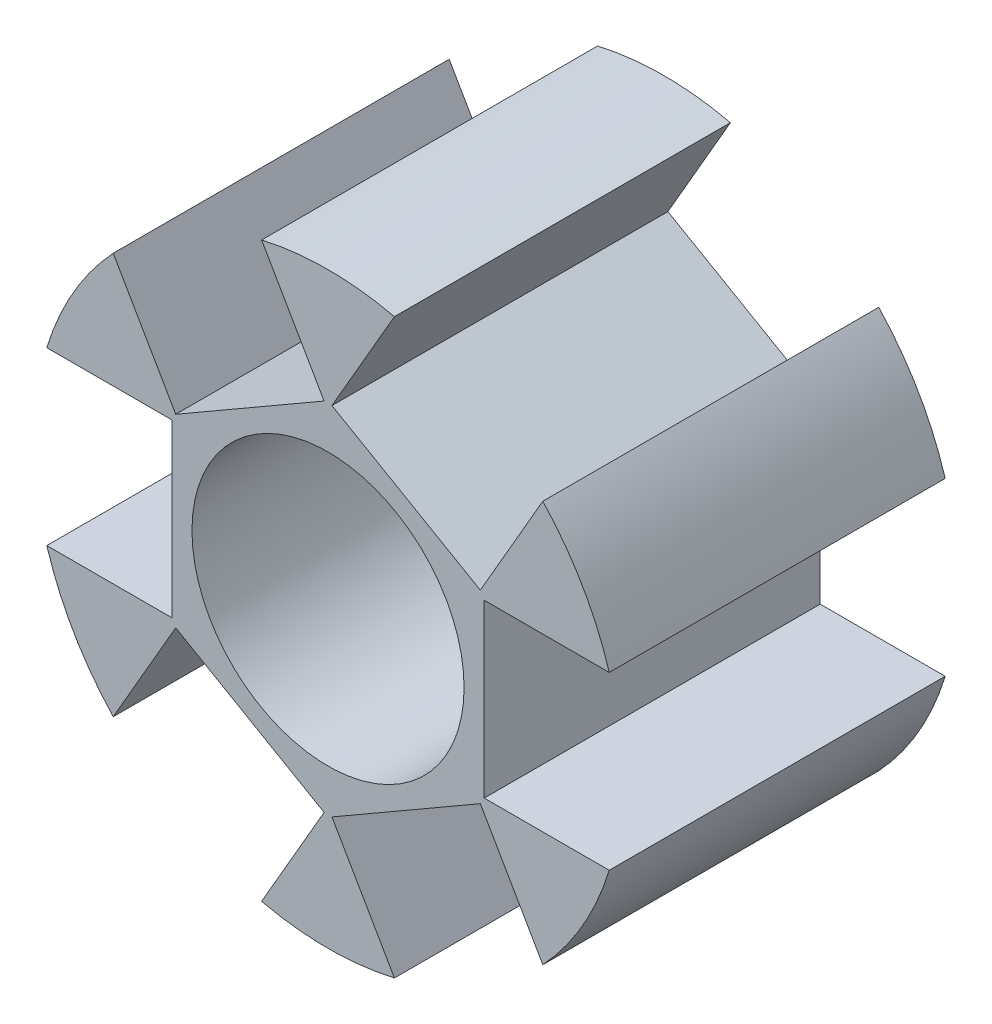
ISO-10303-21;
HEADER;
FILE_DESCRIPTION(('STEP AP214'),'2;1');
FILE_NAME('part.step','',(''),(''),'','','');
FILE_SCHEMA(('AUTOMOTIVE_DESIGN { 1 0 10303 214 1 1 1 1 }'));
ENDSEC;
DATA;
#1=APPLICATION_CONTEXT('core data for automotive mechanical design processes');
#2=APPLICATION_PROTOCOL_DEFINITION('international standard','automotive_design',2000,#1);
#3=PRODUCT_CONTEXT('',#1,'mechanical');
#4=PRODUCT('Part','Part','',(#3));
#5=PRODUCT_RELATED_PRODUCT_CATEGORY('part','',(#4));
#6=PRODUCT_DEFINITION_FORMATION('','',#4);
#7=PRODUCT_DEFINITION_CONTEXT('part definition',#1,'design');
#8=PRODUCT_DEFINITION('design','',#6,#7);
#9=PRODUCT_DEFINITION_SHAPE('','',#8);
#10=(LENGTH_UNIT() NAMED_UNIT(*) SI_UNIT(.MILLI.,.METRE.));
#11=(NAMED_UNIT(*) PLANE_ANGLE_UNIT() SI_UNIT($,.RADIAN.));
#12=(NAMED_UNIT(*) SI_UNIT($,.STERADIAN.) SOLID_ANGLE_UNIT());
#13=UNCERTAINTY_MEASURE_WITH_UNIT(LENGTH_MEASURE(1.E-05),#10,'distance_accuracy_value','');
#14=(GEOMETRIC_REPRESENTATION_CONTEXT(3) GLOBAL_UNCERTAINTY_ASSIGNED_CONTEXT((#13)) GLOBAL_UNIT_ASSIGNED_CONTEXT((#10,
#11,#12)) REPRESENTATION_CONTEXT('',''));
#15=CARTESIAN_POINT('',(0.,0.,0.));
#16=DIRECTION('',(0.,0.,1.));
#17=DIRECTION('',(1.,0.,0.));
#18=AXIS2_PLACEMENT_3D('',#15,#16,#17);
#19=CARTESIAN_POINT('',(0.,0.,5.));
#20=DIRECTION('',(0.,0.,1.));
#21=DIRECTION('',(1.,0.,0.));
#22=AXIS2_PLACEMENT_3D('',#19,#20,#21);
#23=PLANE('',#22);
#24=CARTESIAN_POINT('',(0.,0.,5.));
#25=DIRECTION('',(0.,0.,1.));
#26=DIRECTION('',(1.,0.,0.));
#27=AXIS2_PLACEMENT_3D('',#24,#25,#26);
#28=CIRCLE('',#27,4.05);
#29=CARTESIAN_POINT('',(4.05,0.,5.));
#30=VERTEX_POINT('',#29);
#31=EDGE_CURVE('E337',#30,#30,#28,.T.);
#32=ORIENTED_EDGE('',*,*,#31,.F.);
#33=EDGE_LOOP('',(#32));
#34=FACE_BOUND('',#33,.T.);
#35=DIRECTION('',(-0.866025403784433,-0.50000000000001,0.));
#36=VECTOR('',#35,1.);
#37=CARTESIAN_POINT('',(-0.116635220349743,5.30201812759764,5.));
#38=LINE('',#37,#36);
#39=CARTESIAN_POINT('',(-0.116635220349743,5.30201812759764,5.));
#40=VERTEX_POINT('',#39);
#41=CARTESIAN_POINT('',(-4.53336477965035,2.75201812759759,5.));
#42=VERTEX_POINT('',#41);
#43=EDGE_CURVE('E284',#40,#42,#38,.T.);
#44=ORIENTED_EDGE('',*,*,#43,.T.);
#45=DIRECTION('',(-0.50000000000001,0.866025403784433,0.));
#46=VECTOR('',#45,1.);
#47=CARTESIAN_POINT('',(-4.53336477965035,2.75201812759759,5.));
#48=LINE('',#47,#46);
#49=CARTESIAN_POINT('',(-6.39345737121871,5.97379300297635,5.));
#50=VERTEX_POINT('',#49);
#51=EDGE_CURVE('E287',#42,#50,#48,.T.);
#52=ORIENTED_EDGE('',*,*,#51,.T.);
#53=CARTESIAN_POINT('',(0.,0.,5.));
#54=DIRECTION('',(0.,0.,1.));
#55=DIRECTION('',(1.,0.,0.));
#56=AXIS2_PLACEMENT_3D('',#53,#54,#55);
#57=CIRCLE('',#56,8.75);
#58=CARTESIAN_POINT('',(-8.37018518313663,2.55,5.));
#59=VERTEX_POINT('',#58);
#60=EDGE_CURVE('E350',#50,#59,#57,.T.);
#61=ORIENTED_EDGE('',*,*,#60,.T.);
#62=DIRECTION('',(-1.,0.,0.));
#63=VECTOR('',#62,1.);
#64=CARTESIAN_POINT('',(-4.65,2.55,5.));
#65=LINE('',#64,#63);
#66=CARTESIAN_POINT('',(-4.65,2.55,5.));
#67=VERTEX_POINT('',#66);
#68=EDGE_CURVE('E330',#67,#59,#65,.T.);
#69=ORIENTED_EDGE('',*,*,#68,.F.);
#70=DIRECTION('',(0.,-1.,0.));
#71=VECTOR('',#70,1.);
#72=CARTESIAN_POINT('',(-4.65,2.55,5.));
#73=LINE('',#72,#71);
#74=CARTESIAN_POINT('',(-4.65,-2.55,5.));
#75=VERTEX_POINT('',#74);
#76=EDGE_CURVE('E321',#67,#75,#73,.T.);
#77=ORIENTED_EDGE('',*,*,#76,.T.);
#78=DIRECTION('',(-1.,0.,0.));
#79=VECTOR('',#78,1.);
#80=CARTESIAN_POINT('',(-4.65,-2.55,5.));
#81=LINE('',#80,#79);
#82=CARTESIAN_POINT('',(-8.37018518313663,-2.55,5.));
#83=VERTEX_POINT('',#82);
#84=EDGE_CURVE('E323',#75,#83,#81,.T.);
#85=ORIENTED_EDGE('',*,*,#84,.T.);
#86=CARTESIAN_POINT('',(-6.39345737121862,-5.97379300297644,5.));
#87=VERTEX_POINT('',#86);
#88=EDGE_CURVE('E342',#83,#87,#57,.T.);
#89=ORIENTED_EDGE('',*,*,#88,.T.);
#90=DIRECTION('',(-0.499999999999998,-0.86602540378444,0.));
#91=VECTOR('',#90,1.);
#92=CARTESIAN_POINT('',(-4.53336477965031,-2.75201812759765,5.));
#93=LINE('',#92,#91);
#94=CARTESIAN_POINT('',(-4.53336477965031,-2.75201812759765,5.));
#95=VERTEX_POINT('',#94);
#96=EDGE_CURVE('E306',#95,#87,#93,.T.);
#97=ORIENTED_EDGE('',*,*,#96,.F.);
#98=DIRECTION('',(0.86602540378444,-0.499999999999998,0.));
#99=VECTOR('',#98,1.);
#100=CARTESIAN_POINT('',(-4.53336477965031,-2.75201812759765,5.));
#101=LINE('',#100,#99);
#102=CARTESIAN_POINT('',(-0.116635220349669,-5.30201812759764,5.));
#103=VERTEX_POINT('',#102);
#104=EDGE_CURVE('E297',#95,#103,#101,.T.);
#105=ORIENTED_EDGE('',*,*,#104,.T.);
#106=DIRECTION('',(-0.499999999999998,-0.86602540378444,0.));
#107=VECTOR('',#106,1.);
#108=CARTESIAN_POINT('',(-0.116635220349669,-5.30201812759764,5.));
#109=LINE('',#108,#107);
#110=CARTESIAN_POINT('',(-1.97672781191798,-8.52379300297643,5.));
#111=VERTEX_POINT('',#110);
#112=EDGE_CURVE('E303',#103,#111,#109,.T.);
#113=ORIENTED_EDGE('',*,*,#112,.T.);
#114=CARTESIAN_POINT('',(1.97672781191804,-8.52379300297642,5.));
#115=VERTEX_POINT('',#114);
#116=EDGE_CURVE('E348',#111,#115,#57,.T.);
#117=ORIENTED_EDGE('',*,*,#116,.T.);
#118=DIRECTION('',(0.500000000000004,-0.866025403784436,0.));
#119=VECTOR('',#118,1.);
#120=CARTESIAN_POINT('',(0.116635220349706,-5.30201812759764,5.));
#121=LINE('',#120,#119);
#122=CARTESIAN_POINT('',(0.116635220349706,-5.30201812759764,5.));
#123=VERTEX_POINT('',#122);
#124=EDGE_CURVE('E231',#123,#115,#121,.T.);
#125=ORIENTED_EDGE('',*,*,#124,.F.);
#126=DIRECTION('',(0.866025403784436,0.500000000000004,0.));
#127=VECTOR('',#126,1.);
#128=CARTESIAN_POINT('',(0.116635220349706,-5.30201812759764,5.));
#129=LINE('',#128,#127);
#130=CARTESIAN_POINT('',(4.53336477965033,-2.75201812759762,5.));
#131=VERTEX_POINT('',#130);
#132=EDGE_CURVE('E516',#123,#131,#129,.T.);
#133=ORIENTED_EDGE('',*,*,#132,.T.);
#134=DIRECTION('',(0.500000000000004,-0.866025403784436,0.));
#135=VECTOR('',#134,1.);
#136=CARTESIAN_POINT('',(4.53336477965033,-2.75201812759762,5.));
#137=LINE('',#136,#135);
#138=CARTESIAN_POINT('',(6.39345737121866,-5.9737930029764,5.));
#139=VERTEX_POINT('',#138);
#140=EDGE_CURVE('E216',#131,#139,#137,.T.);
#141=ORIENTED_EDGE('',*,*,#140,.T.);
#142=CARTESIAN_POINT('',(8.37018518313663,-2.55,5.));
#143=VERTEX_POINT('',#142);
#144=EDGE_CURVE('E430',#139,#143,#57,.T.);
#145=ORIENTED_EDGE('',*,*,#144,.T.);
#146=DIRECTION('',(1.,0.,0.));
#147=VECTOR('',#146,1.);
#148=CARTESIAN_POINT('',(4.65,-2.55,5.));
#149=LINE('',#148,#147);
#150=CARTESIAN_POINT('',(4.65,-2.55,5.));
#151=VERTEX_POINT('',#150);
#152=EDGE_CURVE('E255',#151,#143,#149,.T.);
#153=ORIENTED_EDGE('',*,*,#152,.F.);
#154=DIRECTION('',(0.,1.,0.));
#155=VECTOR('',#154,1.);
#156=CARTESIAN_POINT('',(4.65,-2.55,5.));
#157=LINE('',#156,#155);
#158=CARTESIAN_POINT('',(4.65,2.55,5.));
#159=VERTEX_POINT('',#158);
#160=EDGE_CURVE('E246',#151,#159,#157,.T.);
#161=ORIENTED_EDGE('',*,*,#160,.T.);
#162=DIRECTION('',(1.,0.,0.));
#163=VECTOR('',#162,1.);
#164=CARTESIAN_POINT('',(4.65,2.55,5.));
#165=LINE('',#164,#163);
#166=CARTESIAN_POINT('',(8.37018518313663,2.55,5.));
#167=VERTEX_POINT('',#166);
#168=EDGE_CURVE('E248',#159,#167,#165,.T.);
#169=ORIENTED_EDGE('',*,*,#168,.T.);
#170=CARTESIAN_POINT('',(6.39345737121858,5.97379300297649,5.));
#171=VERTEX_POINT('',#170);
#172=EDGE_CURVE('E429',#167,#171,#57,.T.);
#173=ORIENTED_EDGE('',*,*,#172,.T.);
#174=DIRECTION('',(0.499999999999992,0.866025403784443,0.));
#175=VECTOR('',#174,1.);
#176=CARTESIAN_POINT('',(4.53336477965029,2.75201812759768,5.));
#177=LINE('',#176,#175);
#178=CARTESIAN_POINT('',(4.53336477965029,2.75201812759768,5.));
#179=VERTEX_POINT('',#178);
#180=EDGE_CURVE('E63',#179,#171,#177,.T.);
#181=ORIENTED_EDGE('',*,*,#180,.F.);
#182=DIRECTION('',(-0.866025403784443,0.499999999999992,0.));
#183=VECTOR('',#182,1.);
#184=CARTESIAN_POINT('',(4.53336477965029,2.75201812759768,5.));
#185=LINE('',#184,#183);
#186=CARTESIAN_POINT('',(0.116635220349632,5.30201812759764,5.));
#187=VERTEX_POINT('',#186);
#188=EDGE_CURVE('E266',#179,#187,#185,.T.);
#189=ORIENTED_EDGE('',*,*,#188,.T.);
#190=DIRECTION('',(0.499999999999992,0.866025403784443,0.));
#191=VECTOR('',#190,1.);
#192=CARTESIAN_POINT('',(0.116635220349632,5.30201812759764,5.));
#193=LINE('',#192,#191);
#194=CARTESIAN_POINT('',(1.97672781191792,8.52379300297645,5.));
#195=VERTEX_POINT('',#194);
#196=EDGE_CURVE('E268',#187,#195,#193,.T.);
#197=ORIENTED_EDGE('',*,*,#196,.T.);
#198=CARTESIAN_POINT('',(-1.9767278119181,8.52379300297641,5.));
#199=VERTEX_POINT('',#198);
#200=EDGE_CURVE('E433',#195,#199,#57,.T.);
#201=ORIENTED_EDGE('',*,*,#200,.T.);
#202=DIRECTION('',(-0.50000000000001,0.866025403784433,0.));
#203=VECTOR('',#202,1.);
#204=CARTESIAN_POINT('',(-0.116635220349743,5.30201812759764,5.));
#205=LINE('',#204,#203);
#206=EDGE_CURVE('E57',#40,#199,#205,.T.);
#207=ORIENTED_EDGE('',*,*,#206,.F.);
#208=EDGE_LOOP('',(#44,#52,#61,#69,#77,#85,#89,#97,#105,#113,#117,#125,#133,#141,#145,#153,#161,
#169,#173,#181,#189,#197,#201,#207));
#209=FACE_BOUND('',#208,.T.);
#210=ADVANCED_FACE('F41',(#34,#209),#23,.T.);
#211=CARTESIAN_POINT('',(0.,0.,-5.));
#212=DIRECTION('',(0.,0.,1.));
#213=DIRECTION('',(1.,0.,0.));
#214=AXIS2_PLACEMENT_3D('',#211,#212,#213);
#215=PLANE('',#214);
#216=CARTESIAN_POINT('',(0.,0.,-5.));
#217=DIRECTION('',(0.,0.,1.));
#218=DIRECTION('',(1.,0.,0.));
#219=AXIS2_PLACEMENT_3D('',#216,#217,#218);
#220=CIRCLE('',#219,4.05);
#221=CARTESIAN_POINT('',(4.05,0.,-5.));
#222=VERTEX_POINT('',#221);
#223=EDGE_CURVE('E334',#222,#222,#220,.T.);
#224=ORIENTED_EDGE('',*,*,#223,.T.);
#225=EDGE_LOOP('',(#224));
#226=FACE_BOUND('',#225,.T.);
#227=DIRECTION('',(-0.50000000000001,0.866025403784433,0.));
#228=VECTOR('',#227,1.);
#229=CARTESIAN_POINT('',(-4.53336477965035,2.75201812759759,-5.));
#230=LINE('',#229,#228);
#231=CARTESIAN_POINT('',(-4.53336477965035,2.75201812759759,-5.));
#232=VERTEX_POINT('',#231);
#233=CARTESIAN_POINT('',(-6.39345737121871,5.97379300297635,-5.));
#234=VERTEX_POINT('',#233);
#235=EDGE_CURVE('E263',#232,#234,#230,.T.);
#236=ORIENTED_EDGE('',*,*,#235,.F.);
#237=DIRECTION('',(0.866025403784433,0.50000000000001,0.));
#238=VECTOR('',#237,1.);
#239=CARTESIAN_POINT('',(-0.116635220349743,5.30201812759764,-5.));
#240=LINE('',#239,#238);
#241=CARTESIAN_POINT('',(-0.116635220349743,5.30201812759764,-5.));
#242=VERTEX_POINT('',#241);
#243=EDGE_CURVE('E280',#232,#242,#240,.T.);
#244=ORIENTED_EDGE('',*,*,#243,.T.);
#245=DIRECTION('',(-0.50000000000001,0.866025403784433,0.));
#246=VECTOR('',#245,1.);
#247=CARTESIAN_POINT('',(-0.116635220349743,5.30201812759764,-5.));
#248=LINE('',#247,#246);
#249=CARTESIAN_POINT('',(-1.9767278119181,8.52379300297641,-5.));
#250=VERTEX_POINT('',#249);
#251=EDGE_CURVE('E292',#242,#250,#248,.T.);
#252=ORIENTED_EDGE('',*,*,#251,.T.);
#253=CARTESIAN_POINT('',(0.,0.,-5.));
#254=DIRECTION('',(0.,0.,1.));
#255=DIRECTION('',(1.,0.,0.));
#256=AXIS2_PLACEMENT_3D('',#253,#254,#255);
#257=CIRCLE('',#256,8.75);
#258=CARTESIAN_POINT('',(1.97672781191792,8.52379300297645,-5.));
#259=VERTEX_POINT('',#258);
#260=EDGE_CURVE('E378',#259,#250,#257,.T.);
#261=ORIENTED_EDGE('',*,*,#260,.F.);
#262=DIRECTION('',(0.499999999999992,0.866025403784443,0.));
#263=VECTOR('',#262,1.);
#264=CARTESIAN_POINT('',(0.116635220349632,5.30201812759764,-5.));
#265=LINE('',#264,#263);
#266=CARTESIAN_POINT('',(0.116635220349632,5.30201812759764,-5.));
#267=VERTEX_POINT('',#266);
#268=EDGE_CURVE('E241',#267,#259,#265,.T.);
#269=ORIENTED_EDGE('',*,*,#268,.F.);
#270=DIRECTION('',(0.866025403784443,-0.499999999999992,0.));
#271=VECTOR('',#270,1.);
#272=CARTESIAN_POINT('',(4.53336477965029,2.75201812759768,-5.));
#273=LINE('',#272,#271);
#274=CARTESIAN_POINT('',(4.53336477965029,2.75201812759768,-5.));
#275=VERTEX_POINT('',#274);
#276=EDGE_CURVE('E260',#267,#275,#273,.T.);
#277=ORIENTED_EDGE('',*,*,#276,.T.);
#278=DIRECTION('',(0.499999999999992,0.866025403784443,0.));
#279=VECTOR('',#278,1.);
#280=CARTESIAN_POINT('',(4.53336477965029,2.75201812759768,-5.));
#281=LINE('',#280,#279);
#282=CARTESIAN_POINT('',(6.39345737121858,5.97379300297649,-5.));
#283=VERTEX_POINT('',#282);
#284=EDGE_CURVE('E271',#275,#283,#281,.T.);
#285=ORIENTED_EDGE('',*,*,#284,.T.);
#286=CARTESIAN_POINT('',(8.37018518313663,2.55,-5.));
#287=VERTEX_POINT('',#286);
#288=EDGE_CURVE('E385',#287,#283,#257,.T.);
#289=ORIENTED_EDGE('',*,*,#288,.F.);
#290=DIRECTION('',(1.,0.,0.));
#291=VECTOR('',#290,1.);
#292=CARTESIAN_POINT('',(4.65,2.55,-5.));
#293=LINE('',#292,#291);
#294=CARTESIAN_POINT('',(4.65,2.55,-5.));
#295=VERTEX_POINT('',#294);
#296=EDGE_CURVE('E217',#295,#287,#293,.T.);
#297=ORIENTED_EDGE('',*,*,#296,.F.);
#298=DIRECTION('',(0.,-1.,0.));
#299=VECTOR('',#298,1.);
#300=CARTESIAN_POINT('',(4.65,-2.55,-5.));
#301=LINE('',#300,#299);
#302=CARTESIAN_POINT('',(4.65,-2.55,-5.));
#303=VERTEX_POINT('',#302);
#304=EDGE_CURVE('E239',#295,#303,#301,.T.);
#305=ORIENTED_EDGE('',*,*,#304,.T.);
#306=DIRECTION('',(1.,0.,0.));
#307=VECTOR('',#306,1.);
#308=CARTESIAN_POINT('',(4.65,-2.55,-5.));
#309=LINE('',#308,#307);
#310=CARTESIAN_POINT('',(8.37018518313663,-2.55,-5.));
#311=VERTEX_POINT('',#310);
#312=EDGE_CURVE('E251',#303,#311,#309,.T.);
#313=ORIENTED_EDGE('',*,*,#312,.T.);
#314=CARTESIAN_POINT('',(6.39345737121866,-5.9737930029764,-5.));
#315=VERTEX_POINT('',#314);
#316=EDGE_CURVE('E228',#315,#311,#257,.T.);
#317=ORIENTED_EDGE('',*,*,#316,.F.);
#318=DIRECTION('',(0.500000000000004,-0.866025403784436,0.));
#319=VECTOR('',#318,1.);
#320=CARTESIAN_POINT('',(4.53336477965033,-2.75201812759762,-5.));
#321=LINE('',#320,#319);
#322=CARTESIAN_POINT('',(4.53336477965033,-2.75201812759762,-5.));
#323=VERTEX_POINT('',#322);
#324=EDGE_CURVE('E215',#323,#315,#321,.T.);
#325=ORIENTED_EDGE('',*,*,#324,.F.);
#326=DIRECTION('',(-0.866025403784436,-0.500000000000004,0.));
#327=VECTOR('',#326,1.);
#328=CARTESIAN_POINT('',(0.116635220349706,-5.30201812759764,-5.));
#329=LINE('',#328,#327);
#330=CARTESIAN_POINT('',(0.116635220349706,-5.30201812759764,-5.));
#331=VERTEX_POINT('',#330);
#332=EDGE_CURVE('E205',#323,#331,#329,.T.);
#333=ORIENTED_EDGE('',*,*,#332,.T.);
#334=DIRECTION('',(0.500000000000004,-0.866025403784436,0.));
#335=VECTOR('',#334,1.);
#336=CARTESIAN_POINT('',(0.116635220349706,-5.30201812759764,-5.));
#337=LINE('',#336,#335);
#338=CARTESIAN_POINT('',(1.97672781191804,-8.52379300297642,-5.));
#339=VERTEX_POINT('',#338);
#340=EDGE_CURVE('E226',#331,#339,#337,.T.);
#341=ORIENTED_EDGE('',*,*,#340,.T.);
#342=CARTESIAN_POINT('',(-1.97672781191798,-8.52379300297643,-5.));
#343=VERTEX_POINT('',#342);
#344=EDGE_CURVE('E351',#343,#339,#257,.T.);
#345=ORIENTED_EDGE('',*,*,#344,.F.);
#346=DIRECTION('',(-0.499999999999998,-0.86602540378444,0.));
#347=VECTOR('',#346,1.);
#348=CARTESIAN_POINT('',(-0.116635220349669,-5.30201812759764,-5.));
#349=LINE('',#348,#347);
#350=CARTESIAN_POINT('',(-0.116635220349669,-5.30201812759764,-5.));
#351=VERTEX_POINT('',#350);
#352=EDGE_CURVE('E311',#351,#343,#349,.T.);
#353=ORIENTED_EDGE('',*,*,#352,.F.);
#354=DIRECTION('',(-0.86602540378444,0.499999999999998,0.));
#355=VECTOR('',#354,1.);
#356=CARTESIAN_POINT('',(-4.53336477965031,-2.75201812759765,-5.));
#357=LINE('',#356,#355);
#358=CARTESIAN_POINT('',(-4.53336477965031,-2.75201812759765,-5.));
#359=VERTEX_POINT('',#358);
#360=EDGE_CURVE('E233',#351,#359,#357,.T.);
#361=ORIENTED_EDGE('',*,*,#360,.T.);
#362=DIRECTION('',(-0.499999999999998,-0.86602540378444,0.));
#363=VECTOR('',#362,1.);
#364=CARTESIAN_POINT('',(-4.53336477965031,-2.75201812759765,-5.));
#365=LINE('',#364,#363);
#366=CARTESIAN_POINT('',(-6.39345737121862,-5.97379300297644,-5.));
#367=VERTEX_POINT('',#366);
#368=EDGE_CURVE('E308',#359,#367,#365,.T.);
#369=ORIENTED_EDGE('',*,*,#368,.T.);
#370=CARTESIAN_POINT('',(-8.37018518313663,-2.55,-5.));
#371=VERTEX_POINT('',#370);
#372=EDGE_CURVE('E346',#371,#367,#257,.T.);
#373=ORIENTED_EDGE('',*,*,#372,.F.);
#374=DIRECTION('',(-1.,0.,0.));
#375=VECTOR('',#374,1.);
#376=CARTESIAN_POINT('',(-4.65,-2.55,-5.));
#377=LINE('',#376,#375);
#378=CARTESIAN_POINT('',(-4.65,-2.55,-5.));
#379=VERTEX_POINT('',#378);
#380=EDGE_CURVE('E332',#379,#371,#377,.T.);
#381=ORIENTED_EDGE('',*,*,#380,.F.);
#382=DIRECTION('',(0.,1.,0.));
#383=VECTOR('',#382,1.);
#384=CARTESIAN_POINT('',(-4.65,2.55,-5.));
#385=LINE('',#384,#383);
#386=CARTESIAN_POINT('',(-4.65,2.55,-5.));
#387=VERTEX_POINT('',#386);
#388=EDGE_CURVE('E317',#379,#387,#385,.T.);
#389=ORIENTED_EDGE('',*,*,#388,.T.);
#390=DIRECTION('',(-1.,0.,0.));
#391=VECTOR('',#390,1.);
#392=CARTESIAN_POINT('',(-4.65,2.55,-5.));
#393=LINE('',#392,#391);
#394=CARTESIAN_POINT('',(-8.37018518313663,2.55,-5.));
#395=VERTEX_POINT('',#394);
#396=EDGE_CURVE('E329',#387,#395,#393,.T.);
#397=ORIENTED_EDGE('',*,*,#396,.T.);
#398=EDGE_CURVE('E339',#234,#395,#257,.T.);
#399=ORIENTED_EDGE('',*,*,#398,.F.);
#400=EDGE_LOOP('',(#236,#244,#252,#261,#269,#277,#285,#289,#297,#305,#313,#317,#325,#333,#341,
#345,#353,#361,#369,#373,#381,#389,#397,#399));
#401=FACE_BOUND('',#400,.T.);
#402=ADVANCED_FACE('F222',(#226,#401),#215,.F.);
#403=CARTESIAN_POINT('',(0.,0.,5.));
#404=DIRECTION('',(0.,0.,-1.));
#405=DIRECTION('',(-1.,0.,0.));
#406=AXIS2_PLACEMENT_3D('',#403,#404,#405);
#407=CYLINDRICAL_SURFACE('',#406,8.75);
#408=DIRECTION('',(0.,0.,-1.));
#409=VECTOR('',#408,1.);
#410=CARTESIAN_POINT('',(-6.39345737121871,5.97379300297635,5.));
#411=LINE('',#410,#409);
#412=EDGE_CURVE('E11',#234,#50,#411,.F.);
#413=ORIENTED_EDGE('',*,*,#412,.F.);
#414=ORIENTED_EDGE('',*,*,#398,.T.);
#415=DIRECTION('',(0.,0.,-1.));
#416=VECTOR('',#415,1.);
#417=CARTESIAN_POINT('',(-8.37018518313663,2.55,5.));
#418=LINE('',#417,#416);
#419=EDGE_CURVE('E345',#59,#395,#418,.T.);
#420=ORIENTED_EDGE('',*,*,#419,.F.);
#421=ORIENTED_EDGE('',*,*,#60,.F.);
#422=EDGE_LOOP('',(#413,#414,#420,#421));
#423=FACE_BOUND('',#422,.T.);
#424=ADVANCED_FACE('F43',(#423),#407,.T.);
#425=DIRECTION('',(0.,0.,-1.));
#426=VECTOR('',#425,1.);
#427=CARTESIAN_POINT('',(-1.9767278119181,8.52379300297641,5.));
#428=LINE('',#427,#426);
#429=EDGE_CURVE('E47',#199,#250,#428,.T.);
#430=ORIENTED_EDGE('',*,*,#429,.F.);
#431=ORIENTED_EDGE('',*,*,#200,.F.);
#432=DIRECTION('',(0.,0.,-1.));
#433=VECTOR('',#432,1.);
#434=CARTESIAN_POINT('',(1.97672781191792,8.52379300297645,5.));
#435=LINE('',#434,#433);
#436=EDGE_CURVE('E369',#259,#195,#435,.F.);
#437=ORIENTED_EDGE('',*,*,#436,.F.);
#438=ORIENTED_EDGE('',*,*,#260,.T.);
#439=EDGE_LOOP('',(#430,#431,#437,#438));
#440=FACE_BOUND('',#439,.T.);
#441=ADVANCED_FACE('F382',(#440),#407,.T.);
#442=DIRECTION('',(0.,0.,-1.));
#443=VECTOR('',#442,1.);
#444=CARTESIAN_POINT('',(6.39345737121858,5.97379300297649,5.));
#445=LINE('',#444,#443);
#446=EDGE_CURVE('E368',#171,#283,#445,.T.);
#447=ORIENTED_EDGE('',*,*,#446,.F.);
#448=ORIENTED_EDGE('',*,*,#172,.F.);
#449=DIRECTION('',(0.,0.,-1.));
#450=VECTOR('',#449,1.);
#451=CARTESIAN_POINT('',(8.37018518313663,2.55,5.));
#452=LINE('',#451,#450);
#453=EDGE_CURVE('E366',#287,#167,#452,.F.);
#454=ORIENTED_EDGE('',*,*,#453,.F.);
#455=ORIENTED_EDGE('',*,*,#288,.T.);
#456=EDGE_LOOP('',(#447,#448,#454,#455));
#457=FACE_BOUND('',#456,.T.);
#458=ADVANCED_FACE('F504',(#457),#407,.T.);
#459=DIRECTION('',(0.,0.,-1.));
#460=VECTOR('',#459,1.);
#461=CARTESIAN_POINT('',(8.37018518313663,-2.55,5.));
#462=LINE('',#461,#460);
#463=EDGE_CURVE('E364',#143,#311,#462,.T.);
#464=ORIENTED_EDGE('',*,*,#463,.F.);
#465=ORIENTED_EDGE('',*,*,#144,.F.);
#466=DIRECTION('',(0.,0.,-1.));
#467=VECTOR('',#466,1.);
#468=CARTESIAN_POINT('',(6.39345737121866,-5.9737930029764,5.));
#469=LINE('',#468,#467);
#470=EDGE_CURVE('E365',#315,#139,#469,.F.);
#471=ORIENTED_EDGE('',*,*,#470,.F.);
#472=ORIENTED_EDGE('',*,*,#316,.T.);
#473=EDGE_LOOP('',(#464,#465,#471,#472));
#474=FACE_BOUND('',#473,.T.);
#475=ADVANCED_FACE('F514',(#474),#407,.T.);
#476=DIRECTION('',(0.,0.,-1.));
#477=VECTOR('',#476,1.);
#478=CARTESIAN_POINT('',(1.97672781191804,-8.52379300297642,5.));
#479=LINE('',#478,#477);
#480=EDGE_CURVE('E359',#115,#339,#479,.T.);
#481=ORIENTED_EDGE('',*,*,#480,.F.);
#482=ORIENTED_EDGE('',*,*,#116,.F.);
#483=DIRECTION('',(0.,0.,-1.));
#484=VECTOR('',#483,1.);
#485=CARTESIAN_POINT('',(-1.97672781191798,-8.52379300297643,5.));
#486=LINE('',#485,#484);
#487=EDGE_CURVE('E356',#343,#111,#486,.F.);
#488=ORIENTED_EDGE('',*,*,#487,.F.);
#489=ORIENTED_EDGE('',*,*,#344,.T.);
#490=EDGE_LOOP('',(#481,#482,#488,#489));
#491=FACE_BOUND('',#490,.T.);
#492=ADVANCED_FACE('F424',(#491),#407,.T.);
#493=DIRECTION('',(0.,0.,-1.));
#494=VECTOR('',#493,1.);
#495=CARTESIAN_POINT('',(-6.39345737121862,-5.97379300297644,5.));
#496=LINE('',#495,#494);
#497=EDGE_CURVE('E358',#87,#367,#496,.T.);
#498=ORIENTED_EDGE('',*,*,#497,.F.);
#499=ORIENTED_EDGE('',*,*,#88,.F.);
#500=DIRECTION('',(0.,0.,-1.));
#501=VECTOR('',#500,1.);
#502=CARTESIAN_POINT('',(-8.37018518313663,-2.55,5.));
#503=LINE('',#502,#501);
#504=EDGE_CURVE('E353',#371,#83,#503,.F.);
#505=ORIENTED_EDGE('',*,*,#504,.F.);
#506=ORIENTED_EDGE('',*,*,#372,.T.);
#507=EDGE_LOOP('',(#498,#499,#505,#506));
#508=FACE_BOUND('',#507,.T.);
#509=ADVANCED_FACE('F407',(#508),#407,.T.);
#510=CARTESIAN_POINT('',(0.,0.,5.));
#511=DIRECTION('',(0.,0.,-1.));
#512=DIRECTION('',(-1.,0.,0.));
#513=AXIS2_PLACEMENT_3D('',#510,#511,#512);
#514=CYLINDRICAL_SURFACE('',#513,4.05);
#515=ORIENTED_EDGE('',*,*,#31,.T.);
#516=EDGE_LOOP('',(#515));
#517=FACE_BOUND('',#516,.T.);
#518=ORIENTED_EDGE('',*,*,#223,.F.);
#519=EDGE_LOOP('',(#518));
#520=FACE_BOUND('',#519,.T.);
#521=ADVANCED_FACE('F456',(#517,#520),#514,.F.);
#522=CARTESIAN_POINT('',(-4.65,-2.55,5.));
#523=DIRECTION('',(0.,1.,0.));
#524=DIRECTION('',(0.,0.,1.));
#525=AXIS2_PLACEMENT_3D('',#522,#523,#524);
#526=PLANE('',#525);
#527=ORIENTED_EDGE('',*,*,#504,.T.);
#528=ORIENTED_EDGE('',*,*,#84,.F.);
#529=DIRECTION('',(0.,0.,-1.));
#530=VECTOR('',#529,1.);
#531=CARTESIAN_POINT('',(-4.65,-2.55,5.));
#532=LINE('',#531,#530);
#533=EDGE_CURVE('E312',#75,#379,#532,.T.);
#534=ORIENTED_EDGE('',*,*,#533,.T.);
#535=ORIENTED_EDGE('',*,*,#380,.T.);
#536=EDGE_LOOP('',(#527,#528,#534,#535));
#537=FACE_BOUND('',#536,.T.);
#538=ADVANCED_FACE('F399',(#537),#526,.T.);
#539=CARTESIAN_POINT('',(-4.65,2.55,5.));
#540=DIRECTION('',(0.,-1.,0.));
#541=DIRECTION('',(0.,0.,-1.));
#542=AXIS2_PLACEMENT_3D('',#539,#540,#541);
#543=PLANE('',#542);
#544=ORIENTED_EDGE('',*,*,#419,.T.);
#545=ORIENTED_EDGE('',*,*,#396,.F.);
#546=DIRECTION('',(0.,0.,1.));
#547=VECTOR('',#546,1.);
#548=CARTESIAN_POINT('',(-4.65,2.55,5.));
#549=LINE('',#548,#547);
#550=EDGE_CURVE('E316',#387,#67,#549,.T.);
#551=ORIENTED_EDGE('',*,*,#550,.T.);
#552=ORIENTED_EDGE('',*,*,#68,.T.);
#553=EDGE_LOOP('',(#544,#545,#551,#552));
#554=FACE_BOUND('',#553,.T.);
#555=ADVANCED_FACE('F390',(#554),#543,.T.);
#556=CARTESIAN_POINT('',(-4.65,0.,0.));
#557=DIRECTION('',(-1.,0.,0.));
#558=DIRECTION('',(0.,0.,1.));
#559=AXIS2_PLACEMENT_3D('',#556,#557,#558);
#560=PLANE('',#559);
#561=ORIENTED_EDGE('',*,*,#533,.F.);
#562=ORIENTED_EDGE('',*,*,#76,.F.);
#563=ORIENTED_EDGE('',*,*,#550,.F.);
#564=ORIENTED_EDGE('',*,*,#388,.F.);
#565=EDGE_LOOP('',(#561,#562,#563,#564));
#566=FACE_BOUND('',#565,.T.);
#567=ADVANCED_FACE('F400',(#566),#560,.T.);
#568=CARTESIAN_POINT('',(-0.116635220349669,-5.30201812759764,5.));
#569=DIRECTION('',(-0.86602540378444,0.499999999999998,0.));
#570=DIRECTION('',(-0.499999999999998,-0.86602540378444,0.));
#571=AXIS2_PLACEMENT_3D('',#568,#569,#570);
#572=PLANE('',#571);
#573=ORIENTED_EDGE('',*,*,#487,.T.);
#574=ORIENTED_EDGE('',*,*,#112,.F.);
#575=DIRECTION('',(0.,0.,-1.));
#576=VECTOR('',#575,1.);
#577=CARTESIAN_POINT('',(-0.116635220349669,-5.30201812759764,5.));
#578=LINE('',#577,#576);
#579=EDGE_CURVE('E227',#103,#351,#578,.T.);
#580=ORIENTED_EDGE('',*,*,#579,.T.);
#581=ORIENTED_EDGE('',*,*,#352,.T.);
#582=EDGE_LOOP('',(#573,#574,#580,#581));
#583=FACE_BOUND('',#582,.T.);
#584=ADVANCED_FACE('F417',(#583),#572,.T.);
#585=CARTESIAN_POINT('',(-4.53336477965031,-2.75201812759765,5.));
#586=DIRECTION('',(0.86602540378444,-0.499999999999998,0.));
#587=DIRECTION('',(0.499999999999998,0.86602540378444,0.));
#588=AXIS2_PLACEMENT_3D('',#585,#586,#587);
#589=PLANE('',#588);
#590=ORIENTED_EDGE('',*,*,#497,.T.);
#591=ORIENTED_EDGE('',*,*,#368,.F.);
#592=DIRECTION('',(0.,0.,1.));
#593=VECTOR('',#592,1.);
#594=CARTESIAN_POINT('',(-4.53336477965031,-2.75201812759765,5.));
#595=LINE('',#594,#593);
#596=EDGE_CURVE('E296',#359,#95,#595,.T.);
#597=ORIENTED_EDGE('',*,*,#596,.T.);
#598=ORIENTED_EDGE('',*,*,#96,.T.);
#599=EDGE_LOOP('',(#590,#591,#597,#598));
#600=FACE_BOUND('',#599,.T.);
#601=ADVANCED_FACE('F408',(#600),#589,.T.);
#602=CARTESIAN_POINT('',(-2.32499999999999,-4.02701812759764,0.));
#603=DIRECTION('',(-0.499999999999998,-0.86602540378444,0.));
#604=DIRECTION('',(0.,0.,1.));
#605=AXIS2_PLACEMENT_3D('',#602,#603,#604);
#606=PLANE('',#605);
#607=ORIENTED_EDGE('',*,*,#579,.F.);
#608=ORIENTED_EDGE('',*,*,#104,.F.);
#609=ORIENTED_EDGE('',*,*,#596,.F.);
#610=ORIENTED_EDGE('',*,*,#360,.F.);
#611=EDGE_LOOP('',(#607,#608,#609,#610));
#612=FACE_BOUND('',#611,.T.);
#613=ADVANCED_FACE('F414',(#612),#606,.T.);
#614=CARTESIAN_POINT('',(4.53336477965033,-2.75201812759762,5.));
#615=DIRECTION('',(-0.866025403784436,-0.500000000000004,0.));
#616=DIRECTION('',(0.500000000000004,-0.866025403784436,0.));
#617=AXIS2_PLACEMENT_3D('',#614,#615,#616);
#618=PLANE('',#617);
#619=ORIENTED_EDGE('',*,*,#470,.T.);
#620=ORIENTED_EDGE('',*,*,#140,.F.);
#621=DIRECTION('',(0.,0.,-1.));
#622=VECTOR('',#621,1.);
#623=CARTESIAN_POINT('',(4.53336477965033,-2.75201812759762,5.));
#624=LINE('',#623,#622);
#625=EDGE_CURVE('E207',#131,#323,#624,.T.);
#626=ORIENTED_EDGE('',*,*,#625,.T.);
#627=ORIENTED_EDGE('',*,*,#324,.T.);
#628=EDGE_LOOP('',(#619,#620,#626,#627));
#629=FACE_BOUND('',#628,.T.);
#630=ADVANCED_FACE('F213',(#629),#618,.T.);
#631=CARTESIAN_POINT('',(0.116635220349706,-5.30201812759764,5.));
#632=DIRECTION('',(0.866025403784436,0.500000000000004,0.));
#633=DIRECTION('',(-0.500000000000004,0.866025403784436,0.));
#634=AXIS2_PLACEMENT_3D('',#631,#632,#633);
#635=PLANE('',#634);
#636=ORIENTED_EDGE('',*,*,#480,.T.);
#637=ORIENTED_EDGE('',*,*,#340,.F.);
#638=DIRECTION('',(0.,0.,1.));
#639=VECTOR('',#638,1.);
#640=CARTESIAN_POINT('',(0.116635220349706,-5.30201812759764,5.));
#641=LINE('',#640,#639);
#642=EDGE_CURVE('E206',#331,#123,#641,.T.);
#643=ORIENTED_EDGE('',*,*,#642,.T.);
#644=ORIENTED_EDGE('',*,*,#124,.T.);
#645=EDGE_LOOP('',(#636,#637,#643,#644));
#646=FACE_BOUND('',#645,.T.);
#647=ADVANCED_FACE('F513',(#646),#635,.T.);
#648=CARTESIAN_POINT('',(2.32500000000002,-4.02701812759763,0.));
#649=DIRECTION('',(0.500000000000004,-0.866025403784436,0.));
#650=DIRECTION('',(0.,0.,1.));
#651=AXIS2_PLACEMENT_3D('',#648,#649,#650);
#652=PLANE('',#651);
#653=ORIENTED_EDGE('',*,*,#625,.F.);
#654=ORIENTED_EDGE('',*,*,#132,.F.);
#655=ORIENTED_EDGE('',*,*,#642,.F.);
#656=ORIENTED_EDGE('',*,*,#332,.F.);
#657=EDGE_LOOP('',(#653,#654,#655,#656));
#658=FACE_BOUND('',#657,.T.);
#659=ADVANCED_FACE('F203',(#658),#652,.T.);
#660=CARTESIAN_POINT('',(4.65,2.55,5.));
#661=DIRECTION('',(0.,-1.,0.));
#662=DIRECTION('',(0.,0.,-1.));
#663=AXIS2_PLACEMENT_3D('',#660,#661,#662);
#664=PLANE('',#663);
#665=ORIENTED_EDGE('',*,*,#453,.T.);
#666=ORIENTED_EDGE('',*,*,#168,.F.);
#667=DIRECTION('',(0.,0.,-1.));
#668=VECTOR('',#667,1.);
#669=CARTESIAN_POINT('',(4.65,2.55,5.));
#670=LINE('',#669,#668);
#671=EDGE_CURVE('E240',#159,#295,#670,.T.);
#672=ORIENTED_EDGE('',*,*,#671,.T.);
#673=ORIENTED_EDGE('',*,*,#296,.T.);
#674=EDGE_LOOP('',(#665,#666,#672,#673));
#675=FACE_BOUND('',#674,.T.);
#676=ADVANCED_FACE('F486',(#675),#664,.T.);
#677=CARTESIAN_POINT('',(4.65,-2.55,5.));
#678=DIRECTION('',(0.,1.,0.));
#679=DIRECTION('',(0.,0.,1.));
#680=AXIS2_PLACEMENT_3D('',#677,#678,#679);
#681=PLANE('',#680);
#682=ORIENTED_EDGE('',*,*,#463,.T.);
#683=ORIENTED_EDGE('',*,*,#312,.F.);
#684=DIRECTION('',(0.,0.,1.));
#685=VECTOR('',#684,1.);
#686=CARTESIAN_POINT('',(4.65,-2.55,5.));
#687=LINE('',#686,#685);
#688=EDGE_CURVE('E242',#303,#151,#687,.T.);
#689=ORIENTED_EDGE('',*,*,#688,.T.);
#690=ORIENTED_EDGE('',*,*,#152,.T.);
#691=EDGE_LOOP('',(#682,#683,#689,#690));
#692=FACE_BOUND('',#691,.T.);
#693=ADVANCED_FACE('F496',(#692),#681,.T.);
#694=CARTESIAN_POINT('',(4.65,0.,0.));
#695=DIRECTION('',(1.,0.,0.));
#696=DIRECTION('',(0.,0.,1.));
#697=AXIS2_PLACEMENT_3D('',#694,#695,#696);
#698=PLANE('',#697);
#699=ORIENTED_EDGE('',*,*,#671,.F.);
#700=ORIENTED_EDGE('',*,*,#160,.F.);
#701=ORIENTED_EDGE('',*,*,#688,.F.);
#702=ORIENTED_EDGE('',*,*,#304,.F.);
#703=EDGE_LOOP('',(#699,#700,#701,#702));
#704=FACE_BOUND('',#703,.T.);
#705=ADVANCED_FACE('F493',(#704),#698,.T.);
#706=CARTESIAN_POINT('',(0.116635220349632,5.30201812759764,5.));
#707=DIRECTION('',(0.866025403784443,-0.499999999999992,0.));
#708=DIRECTION('',(0.499999999999992,0.866025403784443,0.));
#709=AXIS2_PLACEMENT_3D('',#706,#707,#708);
#710=PLANE('',#709);
#711=ORIENTED_EDGE('',*,*,#436,.T.);
#712=ORIENTED_EDGE('',*,*,#196,.F.);
#713=DIRECTION('',(0.,0.,-1.));
#714=VECTOR('',#713,1.);
#715=CARTESIAN_POINT('',(0.116635220349632,5.30201812759764,5.));
#716=LINE('',#715,#714);
#717=EDGE_CURVE('E257',#187,#267,#716,.T.);
#718=ORIENTED_EDGE('',*,*,#717,.T.);
#719=ORIENTED_EDGE('',*,*,#268,.T.);
#720=EDGE_LOOP('',(#711,#712,#718,#719));
#721=FACE_BOUND('',#720,.T.);
#722=ADVANCED_FACE('F483',(#721),#710,.T.);
#723=CARTESIAN_POINT('',(4.53336477965029,2.75201812759768,5.));
#724=DIRECTION('',(-0.866025403784443,0.499999999999992,0.));
#725=DIRECTION('',(-0.499999999999992,-0.866025403784443,0.));
#726=AXIS2_PLACEMENT_3D('',#723,#724,#725);
#727=PLANE('',#726);
#728=ORIENTED_EDGE('',*,*,#446,.T.);
#729=ORIENTED_EDGE('',*,*,#284,.F.);
#730=DIRECTION('',(0.,0.,1.));
#731=VECTOR('',#730,1.);
#732=CARTESIAN_POINT('',(4.53336477965029,2.75201812759768,5.));
#733=LINE('',#732,#731);
#734=EDGE_CURVE('E262',#275,#179,#733,.T.);
#735=ORIENTED_EDGE('',*,*,#734,.T.);
#736=ORIENTED_EDGE('',*,*,#180,.T.);
#737=EDGE_LOOP('',(#728,#729,#735,#736));
#738=FACE_BOUND('',#737,.T.);
#739=ADVANCED_FACE('F476',(#738),#727,.T.);
#740=CARTESIAN_POINT('',(2.32499999999996,4.02701812759766,0.));
#741=DIRECTION('',(0.499999999999992,0.866025403784443,0.));
#742=DIRECTION('',(0.,0.,1.));
#743=AXIS2_PLACEMENT_3D('',#740,#741,#742);
#744=PLANE('',#743);
#745=ORIENTED_EDGE('',*,*,#717,.F.);
#746=ORIENTED_EDGE('',*,*,#188,.F.);
#747=ORIENTED_EDGE('',*,*,#734,.F.);
#748=ORIENTED_EDGE('',*,*,#276,.F.);
#749=EDGE_LOOP('',(#745,#746,#747,#748));
#750=FACE_BOUND('',#749,.T.);
#751=ADVANCED_FACE('F473',(#750),#744,.T.);
#752=CARTESIAN_POINT('',(-4.53336477965035,2.75201812759759,5.));
#753=DIRECTION('',(0.866025403784433,0.50000000000001,0.));
#754=DIRECTION('',(-0.50000000000001,0.866025403784433,0.));
#755=AXIS2_PLACEMENT_3D('',#752,#753,#754);
#756=PLANE('',#755);
#757=ORIENTED_EDGE('',*,*,#412,.T.);
#758=ORIENTED_EDGE('',*,*,#51,.F.);
#759=DIRECTION('',(0.,0.,-1.));
#760=VECTOR('',#759,1.);
#761=CARTESIAN_POINT('',(-4.53336477965035,2.75201812759759,5.));
#762=LINE('',#761,#760);
#763=EDGE_CURVE('E277',#42,#232,#762,.T.);
#764=ORIENTED_EDGE('',*,*,#763,.T.);
#765=ORIENTED_EDGE('',*,*,#235,.T.);
#766=EDGE_LOOP('',(#757,#758,#764,#765));
#767=FACE_BOUND('',#766,.T.);
#768=ADVANCED_FACE('F438',(#767),#756,.T.);
#769=CARTESIAN_POINT('',(-0.116635220349743,5.30201812759764,5.));
#770=DIRECTION('',(-0.866025403784433,-0.50000000000001,0.));
#771=DIRECTION('',(0.50000000000001,-0.866025403784433,0.));
#772=AXIS2_PLACEMENT_3D('',#769,#770,#771);
#773=PLANE('',#772);
#774=ORIENTED_EDGE('',*,*,#429,.T.);
#775=ORIENTED_EDGE('',*,*,#251,.F.);
#776=DIRECTION('',(0.,0.,1.));
#777=VECTOR('',#776,1.);
#778=CARTESIAN_POINT('',(-0.116635220349743,5.30201812759764,5.));
#779=LINE('',#778,#777);
#780=EDGE_CURVE('E281',#242,#40,#779,.T.);
#781=ORIENTED_EDGE('',*,*,#780,.T.);
#782=ORIENTED_EDGE('',*,*,#206,.T.);
#783=EDGE_LOOP('',(#774,#775,#781,#782));
#784=FACE_BOUND('',#783,.T.);
#785=ADVANCED_FACE('F371',(#784),#773,.T.);
#786=CARTESIAN_POINT('',(-2.32500000000005,4.02701812759761,0.));
#787=DIRECTION('',(-0.50000000000001,0.866025403784433,0.));
#788=DIRECTION('',(0.,0.,1.));
#789=AXIS2_PLACEMENT_3D('',#786,#787,#788);
#790=PLANE('',#789);
#791=ORIENTED_EDGE('',*,*,#763,.F.);
#792=ORIENTED_EDGE('',*,*,#43,.F.);
#793=ORIENTED_EDGE('',*,*,#780,.F.);
#794=ORIENTED_EDGE('',*,*,#243,.F.);
#795=EDGE_LOOP('',(#791,#792,#793,#794));
#796=FACE_BOUND('',#795,.T.);
#797=ADVANCED_FACE('F439',(#796),#790,.T.);
#798=CLOSED_SHELL('',(#210,#402,#424,#441,#458,#475,#492,#509,#521,#538,#555,#567,#584,#601,
#613,#630,#647,#659,#676,#693,#705,#722,#739,#751,#768,#785,#797));
#799=MANIFOLD_SOLID_BREP('B2',#798);
#800=ADVANCED_BREP_SHAPE_REPRESENTATION('',(#18,#799),#14);
#801=SHAPE_DEFINITION_REPRESENTATION(#9,#800);
ENDSEC;
END-ISO-10303-21;
